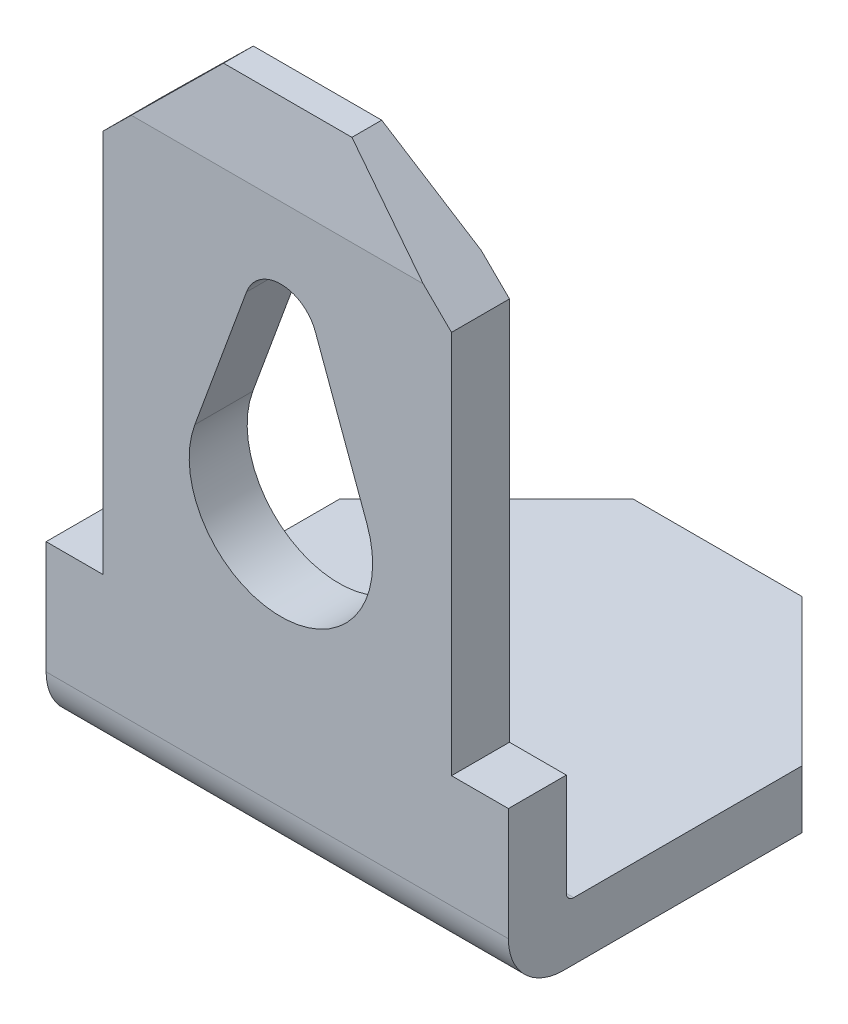
ISO-10303-21;
HEADER;
FILE_DESCRIPTION(('STEP AP214'),'2;1');
FILE_NAME('part.step','',(''),(''),'','','');
FILE_SCHEMA(('AUTOMOTIVE_DESIGN { 1 0 10303 214 1 1 1 1 }'));
ENDSEC;
DATA;
#1=APPLICATION_CONTEXT('core data for automotive mechanical design processes');
#2=APPLICATION_PROTOCOL_DEFINITION('international standard','automotive_design',2000,#1);
#3=PRODUCT_CONTEXT('',#1,'mechanical');
#4=PRODUCT('Part','Part','',(#3));
#5=PRODUCT_RELATED_PRODUCT_CATEGORY('part','',(#4));
#6=PRODUCT_DEFINITION_FORMATION('','',#4);
#7=PRODUCT_DEFINITION_CONTEXT('part definition',#1,'design');
#8=PRODUCT_DEFINITION('design','',#6,#7);
#9=PRODUCT_DEFINITION_SHAPE('','',#8);
#10=(LENGTH_UNIT() NAMED_UNIT(*) SI_UNIT(.MILLI.,.METRE.));
#11=(NAMED_UNIT(*) PLANE_ANGLE_UNIT() SI_UNIT($,.RADIAN.));
#12=(NAMED_UNIT(*) SI_UNIT($,.STERADIAN.) SOLID_ANGLE_UNIT());
#13=UNCERTAINTY_MEASURE_WITH_UNIT(LENGTH_MEASURE(1.E-05),#10,'distance_accuracy_value','');
#14=(GEOMETRIC_REPRESENTATION_CONTEXT(3) GLOBAL_UNCERTAINTY_ASSIGNED_CONTEXT((#13)) GLOBAL_UNIT_ASSIGNED_CONTEXT((#10,
#11,#12)) REPRESENTATION_CONTEXT('',''));
#15=CARTESIAN_POINT('',(0.,0.,0.));
#16=DIRECTION('',(0.,0.,1.));
#17=DIRECTION('',(1.,0.,0.));
#18=AXIS2_PLACEMENT_3D('',#15,#16,#17);
#19=CARTESIAN_POINT('',(6.3,7.11,0.));
#20=DIRECTION('',(0.,-0.214348018272917,0.976757353216485));
#21=DIRECTION('',(0.,-0.976757353216485,-0.214348018272917));
#22=AXIS2_PLACEMENT_3D('',#19,#20,#21);
#23=PLANE('',#22);
#24=DIRECTION('',(-1.,0.,0.));
#25=VECTOR('',#24,1.);
#26=CARTESIAN_POINT('',(6.3,8.21,0.24139344262295));
#27=LINE('',#26,#25);
#28=CARTESIAN_POINT('',(4.025,8.21,0.241393442622949));
#29=VERTEX_POINT('',#28);
#30=CARTESIAN_POINT('',(2.275,8.21,0.241393442622949));
#31=VERTEX_POINT('',#30);
#32=EDGE_CURVE('E205',#29,#31,#27,.T.);
#33=ORIENTED_EDGE('',*,*,#32,.F.);
#34=DIRECTION('',(0.703347952461325,-0.69432379783991,-0.152368374414198));
#35=VECTOR('',#34,1.);
#36=CARTESIAN_POINT('',(5.71349472092454,6.54316914741508,-0.124390228082159));
#37=LINE('',#36,#35);
#38=CARTESIAN_POINT('',(5.13929674470966,7.11,0.));
#39=VERTEX_POINT('',#38);
#40=EDGE_CURVE('E187',#29,#39,#37,.T.);
#41=ORIENTED_EDGE('',*,*,#40,.T.);
#42=DIRECTION('',(-1.,0.,0.));
#43=VECTOR('',#42,1.);
#44=CARTESIAN_POINT('',(6.3,7.11,0.));
#45=LINE('',#44,#43);
#46=CARTESIAN_POINT('',(1.16070325529034,7.11,0.));
#47=VERTEX_POINT('',#46);
#48=EDGE_CURVE('E245',#39,#47,#45,.T.);
#49=ORIENTED_EDGE('',*,*,#48,.T.);
#50=DIRECTION('',(0.703347952461325,0.69432379783991,0.152368374414198));
#51=VECTOR('',#50,1.);
#52=CARTESIAN_POINT('',(3.70310483513415,9.61978184321707,0.550768072151585));
#53=LINE('',#52,#51);
#54=EDGE_CURVE('E253',#47,#31,#53,.T.);
#55=ORIENTED_EDGE('',*,*,#54,.T.);
#56=EDGE_LOOP('',(#33,#41,#49,#55));
#57=FACE_BOUND('',#56,.T.);
#58=ADVANCED_FACE('F33',(#57),#23,.F.);
#59=CARTESIAN_POINT('',(6.3,8.21,0.24139344262295));
#60=DIRECTION('',(0.,-1.,0.));
#61=DIRECTION('',(0.,0.,-1.));
#62=AXIS2_PLACEMENT_3D('',#59,#60,#61);
#63=PLANE('',#62);
#64=DIRECTION('',(-1.,0.,0.));
#65=VECTOR('',#64,1.);
#66=CARTESIAN_POINT('',(6.3,8.21,0.64713114754098));
#67=LINE('',#66,#65);
#68=CARTESIAN_POINT('',(4.025,8.21,0.647131147540979));
#69=VERTEX_POINT('',#68);
#70=CARTESIAN_POINT('',(2.275,8.21,0.647131147540979));
#71=VERTEX_POINT('',#70);
#72=EDGE_CURVE('E202',#69,#71,#67,.T.);
#73=ORIENTED_EDGE('',*,*,#72,.F.);
#74=DIRECTION('',(0.,0.,1.));
#75=VECTOR('',#74,1.);
#76=CARTESIAN_POINT('',(4.025,8.21,-5.21));
#77=LINE('',#76,#75);
#78=EDGE_CURVE('E182',#29,#69,#77,.T.);
#79=ORIENTED_EDGE('',*,*,#78,.F.);
#80=ORIENTED_EDGE('',*,*,#32,.T.);
#81=DIRECTION('',(0.,0.,1.));
#82=VECTOR('',#81,1.);
#83=CARTESIAN_POINT('',(2.275,8.21,-5.21));
#84=LINE('',#83,#82);
#85=EDGE_CURVE('E197',#31,#71,#84,.T.);
#86=ORIENTED_EDGE('',*,*,#85,.T.);
#87=EDGE_LOOP('',(#73,#79,#80,#86));
#88=FACE_BOUND('',#87,.T.);
#89=ADVANCED_FACE('F414',(#88),#63,.F.);
#90=CARTESIAN_POINT('',(6.3,8.21,0.64713114754098));
#91=DIRECTION('',(0.,-0.128798962302804,-0.991670725245896));
#92=DIRECTION('',(0.,0.991670725245896,-0.128798962302804));
#93=AXIS2_PLACEMENT_3D('',#90,#91,#92);
#94=PLANE('',#93);
#95=DIRECTION('',(-1.,0.,0.));
#96=VECTOR('',#95,1.);
#97=CARTESIAN_POINT('',(6.3,7.11,0.79));
#98=LINE('',#97,#96);
#99=CARTESIAN_POINT('',(5.13929674470966,7.11,0.79));
#100=VERTEX_POINT('',#99);
#101=CARTESIAN_POINT('',(1.16070325529034,7.11,0.79));
#102=VERTEX_POINT('',#101);
#103=EDGE_CURVE('E194',#100,#102,#98,.T.);
#104=ORIENTED_EDGE('',*,*,#103,.F.);
#105=DIRECTION('',(-0.708713311399784,0.69962031769454,-0.0908672290418487));
#106=VECTOR('',#105,1.);
#107=CARTESIAN_POINT('',(5.16767461889319,7.0819862220274,0.793638451192715));
#108=LINE('',#107,#106);
#109=EDGE_CURVE('E179',#100,#69,#108,.T.);
#110=ORIENTED_EDGE('',*,*,#109,.T.);
#111=ORIENTED_EDGE('',*,*,#72,.T.);
#112=DIRECTION('',(-0.708713311399784,-0.69962031769454,0.0908672290418487));
#113=VECTOR('',#112,1.);
#114=CARTESIAN_POINT('',(4.29665509496487,10.2057166841054,0.387925918003296));
#115=LINE('',#114,#113);
#116=EDGE_CURVE('E201',#71,#102,#115,.T.);
#117=ORIENTED_EDGE('',*,*,#116,.T.);
#118=EDGE_LOOP('',(#104,#110,#111,#117));
#119=FACE_BOUND('',#118,.T.);
#120=ADVANCED_FACE('F200',(#119),#94,.F.);
#121=CARTESIAN_POINT('',(6.3,7.11,0.79));
#122=DIRECTION('',(0.,0.,-1.));
#123=DIRECTION('',(0.,1.,0.));
#124=AXIS2_PLACEMENT_3D('',#121,#122,#123);
#125=PLANE('',#124);
#126=DIRECTION('',(-0.344583937553277,-0.938755511291561,0.));
#127=VECTOR('',#126,1.);
#128=CARTESIAN_POINT('',(2.73062224435422,5.80882986931079,0.789999999999999));
#129=LINE('',#128,#127);
#130=CARTESIAN_POINT('',(2.73062224435422,5.80882986931079,0.79));
#131=VERTEX_POINT('',#130);
#132=CARTESIAN_POINT('',(2.02655561088555,3.89072992194159,0.789999999999999));
#133=VERTEX_POINT('',#132);
#134=EDGE_CURVE('E294',#131,#133,#129,.T.);
#135=ORIENTED_EDGE('',*,*,#134,.F.);
#136=CARTESIAN_POINT('',(3.2,5.63653790053415,0.789999999999999));
#137=DIRECTION('',(0.,0.,1.));
#138=DIRECTION('',(1.,0.,0.));
#139=AXIS2_PLACEMENT_3D('',#136,#137,#138);
#140=CIRCLE('',#139,0.5);
#141=CARTESIAN_POINT('',(3.66963395220552,5.8081302981974,0.789999999999999));
#142=VERTEX_POINT('',#141);
#143=EDGE_CURVE('E270',#142,#131,#140,.T.);
#144=ORIENTED_EDGE('',*,*,#143,.F.);
#145=DIRECTION('',(-0.344584192655147,0.938755417652649,0.));
#146=VECTOR('',#145,1.);
#147=CARTESIAN_POINT('',(3.66963395220552,5.8081302981974,0.789999999999999));
#148=LINE('',#147,#146);
#149=CARTESIAN_POINT('',(4.37344427206581,3.89073024081893,0.789999999999999));
#150=VERTEX_POINT('',#149);
#151=EDGE_CURVE('E300',#150,#142,#148,.T.);
#152=ORIENTED_EDGE('',*,*,#151,.F.);
#153=CARTESIAN_POINT('',(3.2,3.46,0.789999999999999));
#154=DIRECTION('',(0.,0.,1.));
#155=DIRECTION('',(1.,0.,0.));
#156=AXIS2_PLACEMENT_3D('',#153,#154,#155);
#157=CIRCLE('',#156,1.25);
#158=EDGE_CURVE('E297',#133,#150,#157,.T.);
#159=ORIENTED_EDGE('',*,*,#158,.F.);
#160=EDGE_LOOP('',(#135,#144,#152,#159));
#161=FACE_BOUND('',#160,.T.);
#162=DIRECTION('',(0.,-1.,0.));
#163=VECTOR('',#162,1.);
#164=CARTESIAN_POINT('',(5.525,1.49672365683442,0.789999999999999));
#165=LINE('',#164,#163);
#166=CARTESIAN_POINT('',(5.525,6.729245427366,0.79));
#167=VERTEX_POINT('',#166);
#168=CARTESIAN_POINT('',(5.525,1.49672365683442,0.789999999999999));
#169=VERTEX_POINT('',#168);
#170=EDGE_CURVE('E196',#167,#169,#165,.T.);
#171=ORIENTED_EDGE('',*,*,#170,.F.);
#172=DIRECTION('',(0.711657426770076,-0.702526659225822,0.));
#173=VECTOR('',#172,1.);
#174=CARTESIAN_POINT('',(5.54449556096771,6.71,0.79));
#175=LINE('',#174,#173);
#176=EDGE_CURVE('E55',#100,#167,#175,.T.);
#177=ORIENTED_EDGE('',*,*,#176,.F.);
#178=ORIENTED_EDGE('',*,*,#103,.T.);
#179=DIRECTION('',(0.711657426770076,0.702526659225822,0.));
#180=VECTOR('',#179,1.);
#181=CARTESIAN_POINT('',(0.755504439032288,6.71,0.79));
#182=LINE('',#181,#180);
#183=CARTESIAN_POINT('',(0.775,6.729245427366,0.79));
#184=VERTEX_POINT('',#183);
#185=EDGE_CURVE('E562',#184,#102,#182,.T.);
#186=ORIENTED_EDGE('',*,*,#185,.F.);
#187=DIRECTION('',(0.,1.,0.));
#188=VECTOR('',#187,1.);
#189=CARTESIAN_POINT('',(0.775,1.49672365683442,0.789999999999999));
#190=LINE('',#189,#188);
#191=CARTESIAN_POINT('',(0.775,1.49672365683442,0.789999999999999));
#192=VERTEX_POINT('',#191);
#193=EDGE_CURVE('E271',#192,#184,#190,.T.);
#194=ORIENTED_EDGE('',*,*,#193,.F.);
#195=DIRECTION('',(1.,0.,0.));
#196=VECTOR('',#195,1.);
#197=CARTESIAN_POINT('',(0.,1.49672365683442,0.789999999999999));
#198=LINE('',#197,#196);
#199=CARTESIAN_POINT('',(0.,1.49672365683442,0.789999999999999));
#200=VERTEX_POINT('',#199);
#201=EDGE_CURVE('E264',#200,#192,#198,.T.);
#202=ORIENTED_EDGE('',*,*,#201,.F.);
#203=DIRECTION('',(0.,-1.,0.));
#204=VECTOR('',#203,1.);
#205=CARTESIAN_POINT('',(0.,7.11,0.79));
#206=LINE('',#205,#204);
#207=CARTESIAN_POINT('',(0.,-0.0400000000000005,0.789999999999999));
#208=VERTEX_POINT('',#207);
#209=EDGE_CURVE('E312',#200,#208,#206,.T.);
#210=ORIENTED_EDGE('',*,*,#209,.T.);
#211=DIRECTION('',(-1.,0.,0.));
#212=VECTOR('',#211,1.);
#213=CARTESIAN_POINT('',(6.3,-0.0400000000000005,0.789999999999999));
#214=LINE('',#213,#212);
#215=CARTESIAN_POINT('',(6.3,-0.0400000000000005,0.789999999999999));
#216=VERTEX_POINT('',#215);
#217=EDGE_CURVE('E203',#216,#208,#214,.T.);
#218=ORIENTED_EDGE('',*,*,#217,.F.);
#219=DIRECTION('',(0.,-1.,0.));
#220=VECTOR('',#219,1.);
#221=CARTESIAN_POINT('',(6.3,7.11,0.79));
#222=LINE('',#221,#220);
#223=CARTESIAN_POINT('',(6.3,1.49672365683442,0.789999999999999));
#224=VERTEX_POINT('',#223);
#225=EDGE_CURVE('E313',#224,#216,#222,.T.);
#226=ORIENTED_EDGE('',*,*,#225,.F.);
#227=DIRECTION('',(1.,0.,0.));
#228=VECTOR('',#227,1.);
#229=CARTESIAN_POINT('',(6.3,1.49672365683442,0.789999999999999));
#230=LINE('',#229,#228);
#231=EDGE_CURVE('E259',#169,#224,#230,.T.);
#232=ORIENTED_EDGE('',*,*,#231,.F.);
#233=EDGE_LOOP('',(#171,#177,#178,#186,#194,#202,#210,#218,#226,#232));
#234=FACE_BOUND('',#233,.T.);
#235=ADVANCED_FACE('F192',(#161,#234),#125,.F.);
#236=CARTESIAN_POINT('',(6.3,-0.0400000000000006,0.0399999999999991));
#237=DIRECTION('',(-1.,0.,0.));
#238=DIRECTION('',(0.,0.,1.));
#239=AXIS2_PLACEMENT_3D('',#236,#237,#238);
#240=CYLINDRICAL_SURFACE('',#239,0.75);
#241=CARTESIAN_POINT('',(0.,-0.0400000000000006,0.0399999999999991));
#242=DIRECTION('',(1.,0.,0.));
#243=DIRECTION('',(0.,0.,-1.));
#244=AXIS2_PLACEMENT_3D('',#241,#242,#243);
#245=CIRCLE('',#244,0.75);
#246=CARTESIAN_POINT('',(0.,-0.790000000000001,0.0399999999999991));
#247=VERTEX_POINT('',#246);
#248=EDGE_CURVE('E329',#208,#247,#245,.T.);
#249=ORIENTED_EDGE('',*,*,#248,.T.);
#250=DIRECTION('',(-1.,0.,0.));
#251=VECTOR('',#250,1.);
#252=CARTESIAN_POINT('',(6.3,-0.790000000000001,0.0399999999999991));
#253=LINE('',#252,#251);
#254=CARTESIAN_POINT('',(6.3,-0.790000000000001,0.0399999999999991));
#255=VERTEX_POINT('',#254);
#256=EDGE_CURVE('E208',#255,#247,#253,.T.);
#257=ORIENTED_EDGE('',*,*,#256,.F.);
#258=CARTESIAN_POINT('',(6.3,-0.0400000000000006,0.0399999999999991));
#259=DIRECTION('',(1.,0.,0.));
#260=DIRECTION('',(0.,0.,-1.));
#261=AXIS2_PLACEMENT_3D('',#258,#259,#260);
#262=CIRCLE('',#261,0.75);
#263=EDGE_CURVE('E315',#216,#255,#262,.T.);
#264=ORIENTED_EDGE('',*,*,#263,.F.);
#265=ORIENTED_EDGE('',*,*,#217,.T.);
#266=EDGE_LOOP('',(#249,#257,#264,#265));
#267=FACE_BOUND('',#266,.T.);
#268=ADVANCED_FACE('F385',(#267),#240,.T.);
#269=CARTESIAN_POINT('',(6.3,-0.790000000000001,0.0399999999999991));
#270=DIRECTION('',(0.,1.,0.));
#271=DIRECTION('',(0.,0.,1.));
#272=AXIS2_PLACEMENT_3D('',#269,#270,#271);
#273=PLANE('',#272);
#274=DIRECTION('',(-1.,0.,0.));
#275=VECTOR('',#274,1.);
#276=CARTESIAN_POINT('',(6.3,-0.790000000000001,-5.21));
#277=LINE('',#276,#275);
#278=CARTESIAN_POINT('',(4.29999999999999,-0.790000000000001,-5.21));
#279=VERTEX_POINT('',#278);
#280=CARTESIAN_POINT('',(2.,-0.790000000000001,-5.21));
#281=VERTEX_POINT('',#280);
#282=EDGE_CURVE('E350',#279,#281,#277,.T.);
#283=ORIENTED_EDGE('',*,*,#282,.F.);
#284=DIRECTION('',(0.707106781186549,0.,0.707106781186546));
#285=VECTOR('',#284,1.);
#286=CARTESIAN_POINT('',(6.3,-0.790000000000001,-3.21));
#287=LINE('',#286,#285);
#288=CARTESIAN_POINT('',(6.3,-0.790000000000001,-3.21));
#289=VERTEX_POINT('',#288);
#290=EDGE_CURVE('E228',#279,#289,#287,.T.);
#291=ORIENTED_EDGE('',*,*,#290,.T.);
#292=DIRECTION('',(0.,0.,-1.));
#293=VECTOR('',#292,1.);
#294=CARTESIAN_POINT('',(6.3,-0.790000000000001,0.0399999999999991));
#295=LINE('',#294,#293);
#296=EDGE_CURVE('E318',#255,#289,#295,.T.);
#297=ORIENTED_EDGE('',*,*,#296,.F.);
#298=ORIENTED_EDGE('',*,*,#256,.T.);
#299=DIRECTION('',(0.,0.,-1.));
#300=VECTOR('',#299,1.);
#301=CARTESIAN_POINT('',(0.,-0.790000000000001,0.0399999999999991));
#302=LINE('',#301,#300);
#303=CARTESIAN_POINT('',(0.,-0.790000000000001,-3.21));
#304=VERTEX_POINT('',#303);
#305=EDGE_CURVE('E331',#247,#304,#302,.T.);
#306=ORIENTED_EDGE('',*,*,#305,.T.);
#307=DIRECTION('',(-0.707106781186546,0.,0.707106781186549));
#308=VECTOR('',#307,1.);
#309=CARTESIAN_POINT('',(2.,-0.790000000000001,-5.21));
#310=LINE('',#309,#308);
#311=EDGE_CURVE('E226',#304,#281,#310,.F.);
#312=ORIENTED_EDGE('',*,*,#311,.T.);
#313=EDGE_LOOP('',(#283,#291,#297,#298,#306,#312));
#314=FACE_BOUND('',#313,.T.);
#315=ADVANCED_FACE('F358',(#314),#273,.F.);
#316=CARTESIAN_POINT('',(6.3,-0.790000000000001,-5.21));
#317=DIRECTION('',(0.,0.,1.));
#318=DIRECTION('',(1.,0.,0.));
#319=AXIS2_PLACEMENT_3D('',#316,#317,#318);
#320=PLANE('',#319);
#321=DIRECTION('',(-1.,0.,0.));
#322=VECTOR('',#321,1.);
#323=CARTESIAN_POINT('',(6.3,0.,-5.21));
#324=LINE('',#323,#322);
#325=CARTESIAN_POINT('',(4.29999999999999,0.,-5.21));
#326=VERTEX_POINT('',#325);
#327=CARTESIAN_POINT('',(2.,0.,-5.21));
#328=VERTEX_POINT('',#327);
#329=EDGE_CURVE('E347',#326,#328,#324,.T.);
#330=ORIENTED_EDGE('',*,*,#329,.F.);
#331=DIRECTION('',(0.,-1.,0.));
#332=VECTOR('',#331,1.);
#333=CARTESIAN_POINT('',(4.29999999999999,-0.790000000000001,-5.21));
#334=LINE('',#333,#332);
#335=EDGE_CURVE('E224',#326,#279,#334,.T.);
#336=ORIENTED_EDGE('',*,*,#335,.T.);
#337=ORIENTED_EDGE('',*,*,#282,.T.);
#338=DIRECTION('',(0.,1.,0.));
#339=VECTOR('',#338,1.);
#340=CARTESIAN_POINT('',(2.,-0.790000000000001,-5.21));
#341=LINE('',#340,#339);
#342=EDGE_CURVE('E221',#281,#328,#341,.T.);
#343=ORIENTED_EDGE('',*,*,#342,.T.);
#344=EDGE_LOOP('',(#330,#336,#337,#343));
#345=FACE_BOUND('',#344,.T.);
#346=ADVANCED_FACE('F374',(#345),#320,.F.);
#347=CARTESIAN_POINT('',(6.3,0.,-5.21));
#348=DIRECTION('',(0.,-1.,0.));
#349=DIRECTION('',(0.,0.,-1.));
#350=AXIS2_PLACEMENT_3D('',#347,#348,#349);
#351=PLANE('',#350);
#352=DIRECTION('',(0.,0.,1.));
#353=VECTOR('',#352,1.);
#354=CARTESIAN_POINT('',(6.3,0.,-5.21));
#355=LINE('',#354,#353);
#356=CARTESIAN_POINT('',(6.3,0.,-3.21));
#357=VERTEX_POINT('',#356);
#358=CARTESIAN_POINT('',(6.3,0.,-0.100000000000001));
#359=VERTEX_POINT('',#358);
#360=EDGE_CURVE('E321',#357,#359,#355,.T.);
#361=ORIENTED_EDGE('',*,*,#360,.F.);
#362=DIRECTION('',(-0.707106781186549,0.,-0.707106781186546));
#363=VECTOR('',#362,1.);
#364=CARTESIAN_POINT('',(6.3,0.,-3.21));
#365=LINE('',#364,#363);
#366=EDGE_CURVE('E219',#357,#326,#365,.T.);
#367=ORIENTED_EDGE('',*,*,#366,.T.);
#368=ORIENTED_EDGE('',*,*,#329,.T.);
#369=DIRECTION('',(0.707106781186546,0.,-0.707106781186549));
#370=VECTOR('',#369,1.);
#371=CARTESIAN_POINT('',(2.,0.,-5.21));
#372=LINE('',#371,#370);
#373=CARTESIAN_POINT('',(0.,0.,-3.21));
#374=VERTEX_POINT('',#373);
#375=EDGE_CURVE('E217',#328,#374,#372,.F.);
#376=ORIENTED_EDGE('',*,*,#375,.T.);
#377=DIRECTION('',(0.,0.,1.));
#378=VECTOR('',#377,1.);
#379=CARTESIAN_POINT('',(0.,0.,-5.21));
#380=LINE('',#379,#378);
#381=CARTESIAN_POINT('',(0.,0.,-0.100000000000001));
#382=VERTEX_POINT('',#381);
#383=EDGE_CURVE('E334',#374,#382,#380,.T.);
#384=ORIENTED_EDGE('',*,*,#383,.T.);
#385=DIRECTION('',(-1.,0.,0.));
#386=VECTOR('',#385,1.);
#387=CARTESIAN_POINT('',(6.3,0.,-0.100000000000001));
#388=LINE('',#387,#386);
#389=EDGE_CURVE('E344',#359,#382,#388,.T.);
#390=ORIENTED_EDGE('',*,*,#389,.F.);
#391=EDGE_LOOP('',(#361,#367,#368,#376,#384,#390));
#392=FACE_BOUND('',#391,.T.);
#393=ADVANCED_FACE('F399',(#392),#351,.F.);
#394=CARTESIAN_POINT('',(6.3,0.1,-0.1));
#395=DIRECTION('',(-1.,0.,0.));
#396=DIRECTION('',(0.,0.,1.));
#397=AXIS2_PLACEMENT_3D('',#394,#395,#396);
#398=CYLINDRICAL_SURFACE('',#397,0.1);
#399=CARTESIAN_POINT('',(0.,0.1,-0.1));
#400=DIRECTION('',(-1.,0.,0.));
#401=DIRECTION('',(0.,0.,-1.));
#402=AXIS2_PLACEMENT_3D('',#399,#400,#401);
#403=CIRCLE('',#402,0.1);
#404=CARTESIAN_POINT('',(0.,0.100000000000001,0.));
#405=VERTEX_POINT('',#404);
#406=EDGE_CURVE('E336',#382,#405,#403,.T.);
#407=ORIENTED_EDGE('',*,*,#406,.T.);
#408=DIRECTION('',(-1.,0.,0.));
#409=VECTOR('',#408,1.);
#410=CARTESIAN_POINT('',(6.3,0.100000000000001,0.));
#411=LINE('',#410,#409);
#412=CARTESIAN_POINT('',(6.3,0.100000000000001,0.));
#413=VERTEX_POINT('',#412);
#414=EDGE_CURVE('E341',#413,#405,#411,.T.);
#415=ORIENTED_EDGE('',*,*,#414,.F.);
#416=CARTESIAN_POINT('',(6.3,0.1,-0.1));
#417=DIRECTION('',(-1.,0.,0.));
#418=DIRECTION('',(0.,0.,-1.));
#419=AXIS2_PLACEMENT_3D('',#416,#417,#418);
#420=CIRCLE('',#419,0.1);
#421=EDGE_CURVE('E323',#359,#413,#420,.T.);
#422=ORIENTED_EDGE('',*,*,#421,.F.);
#423=ORIENTED_EDGE('',*,*,#389,.T.);
#424=EDGE_LOOP('',(#407,#415,#422,#423));
#425=FACE_BOUND('',#424,.T.);
#426=ADVANCED_FACE('F396',(#425),#398,.F.);
#427=CARTESIAN_POINT('',(6.3,0.100000000000001,0.));
#428=DIRECTION('',(0.,0.,1.));
#429=DIRECTION('',(0.,-1.,0.));
#430=AXIS2_PLACEMENT_3D('',#427,#428,#429);
#431=PLANE('',#430);
#432=DIRECTION('',(0.344584192655147,-0.938755417652649,0.));
#433=VECTOR('',#432,1.);
#434=CARTESIAN_POINT('',(3.66963395220552,5.8081302981974,0.));
#435=LINE('',#434,#433);
#436=CARTESIAN_POINT('',(3.66963395220552,5.8081302981974,0.));
#437=VERTEX_POINT('',#436);
#438=CARTESIAN_POINT('',(4.37344427206581,3.89073024081893,0.));
#439=VERTEX_POINT('',#438);
#440=EDGE_CURVE('E287',#437,#439,#435,.T.);
#441=ORIENTED_EDGE('',*,*,#440,.F.);
#442=CARTESIAN_POINT('',(3.2,5.63653790053415,0.));
#443=DIRECTION('',(0.,0.,1.));
#444=DIRECTION('',(0.,-1.,0.));
#445=AXIS2_PLACEMENT_3D('',#442,#443,#444);
#446=CIRCLE('',#445,0.5);
#447=CARTESIAN_POINT('',(2.73062224435422,5.80882986931079,0.));
#448=VERTEX_POINT('',#447);
#449=EDGE_CURVE('E290',#448,#437,#446,.F.);
#450=ORIENTED_EDGE('',*,*,#449,.F.);
#451=DIRECTION('',(0.344583937553277,0.938755511291561,0.));
#452=VECTOR('',#451,1.);
#453=CARTESIAN_POINT('',(2.73062224435422,5.80882986931079,0.));
#454=LINE('',#453,#452);
#455=CARTESIAN_POINT('',(2.02655561088555,3.89072992194159,0.));
#456=VERTEX_POINT('',#455);
#457=EDGE_CURVE('E292',#456,#448,#454,.T.);
#458=ORIENTED_EDGE('',*,*,#457,.F.);
#459=CARTESIAN_POINT('',(3.2,3.46,0.));
#460=DIRECTION('',(0.,0.,1.));
#461=DIRECTION('',(0.,-1.,0.));
#462=AXIS2_PLACEMENT_3D('',#459,#460,#461);
#463=CIRCLE('',#462,1.25);
#464=EDGE_CURVE('E284',#439,#456,#463,.F.);
#465=ORIENTED_EDGE('',*,*,#464,.F.);
#466=EDGE_LOOP('',(#441,#450,#458,#465));
#467=FACE_BOUND('',#466,.T.);
#468=ORIENTED_EDGE('',*,*,#48,.F.);
#469=DIRECTION('',(0.711657426770076,-0.702526659225822,0.));
#470=VECTOR('',#469,1.);
#471=CARTESIAN_POINT('',(9.23184999768602,3.06995537127141,0.));
#472=LINE('',#471,#470);
#473=CARTESIAN_POINT('',(5.525,6.729245427366,0.));
#474=VERTEX_POINT('',#473);
#475=EDGE_CURVE('E238',#39,#474,#472,.T.);
#476=ORIENTED_EDGE('',*,*,#475,.T.);
#477=DIRECTION('',(0.,1.,0.));
#478=VECTOR('',#477,1.);
#479=CARTESIAN_POINT('',(5.525,1.49672365683442,0.));
#480=LINE('',#479,#478);
#481=CARTESIAN_POINT('',(5.525,1.49672365683442,0.));
#482=VERTEX_POINT('',#481);
#483=EDGE_CURVE('E236',#482,#474,#480,.T.);
#484=ORIENTED_EDGE('',*,*,#483,.F.);
#485=DIRECTION('',(-1.,0.,0.));
#486=VECTOR('',#485,1.);
#487=CARTESIAN_POINT('',(6.3,1.49672365683442,0.));
#488=LINE('',#487,#486);
#489=CARTESIAN_POINT('',(6.3,1.49672365683442,0.));
#490=VERTEX_POINT('',#489);
#491=EDGE_CURVE('E261',#490,#482,#488,.T.);
#492=ORIENTED_EDGE('',*,*,#491,.F.);
#493=DIRECTION('',(0.,1.,0.));
#494=VECTOR('',#493,1.);
#495=CARTESIAN_POINT('',(6.3,0.100000000000001,0.));
#496=LINE('',#495,#494);
#497=EDGE_CURVE('E325',#413,#490,#496,.T.);
#498=ORIENTED_EDGE('',*,*,#497,.F.);
#499=ORIENTED_EDGE('',*,*,#414,.T.);
#500=DIRECTION('',(0.,1.,0.));
#501=VECTOR('',#500,1.);
#502=CARTESIAN_POINT('',(0.,0.100000000000001,0.));
#503=LINE('',#502,#501);
#504=CARTESIAN_POINT('',(0.,1.49672365683442,0.));
#505=VERTEX_POINT('',#504);
#506=EDGE_CURVE('E316',#405,#505,#503,.T.);
#507=ORIENTED_EDGE('',*,*,#506,.T.);
#508=DIRECTION('',(-1.,0.,0.));
#509=VECTOR('',#508,1.);
#510=CARTESIAN_POINT('',(0.,1.49672365683442,0.));
#511=LINE('',#510,#509);
#512=CARTESIAN_POINT('',(0.775,1.49672365683442,0.));
#513=VERTEX_POINT('',#512);
#514=EDGE_CURVE('E277',#513,#505,#511,.T.);
#515=ORIENTED_EDGE('',*,*,#514,.F.);
#516=DIRECTION('',(0.,-1.,0.));
#517=VECTOR('',#516,1.);
#518=CARTESIAN_POINT('',(0.775,1.49672365683442,0.));
#519=LINE('',#518,#517);
#520=CARTESIAN_POINT('',(0.775,6.729245427366,0.));
#521=VERTEX_POINT('',#520);
#522=EDGE_CURVE('E257',#521,#513,#519,.T.);
#523=ORIENTED_EDGE('',*,*,#522,.F.);
#524=DIRECTION('',(0.711657426770076,0.702526659225822,0.));
#525=VECTOR('',#524,1.);
#526=CARTESIAN_POINT('',(0.258824648699115,6.21969275288617,0.));
#527=LINE('',#526,#525);
#528=EDGE_CURVE('E48',#521,#47,#527,.T.);
#529=ORIENTED_EDGE('',*,*,#528,.T.);
#530=EDGE_LOOP('',(#468,#476,#484,#492,#498,#499,#507,#515,#523,#529));
#531=FACE_BOUND('',#530,.T.);
#532=ADVANCED_FACE('F242',(#467,#531),#431,.F.);
#533=CARTESIAN_POINT('',(6.3,-0.0400000000000006,0.0399999999999991));
#534=DIRECTION('',(1.,0.,0.));
#535=DIRECTION('',(0.,0.,-1.));
#536=AXIS2_PLACEMENT_3D('',#533,#534,#535);
#537=PLANE('',#536);
#538=DIRECTION('',(0.,0.,-1.));
#539=VECTOR('',#538,1.);
#540=CARTESIAN_POINT('',(6.3,1.49672365683442,7.54786240313508));
#541=LINE('',#540,#539);
#542=EDGE_CURVE('E266',#224,#490,#541,.T.);
#543=ORIENTED_EDGE('',*,*,#542,.F.);
#544=ORIENTED_EDGE('',*,*,#225,.T.);
#545=ORIENTED_EDGE('',*,*,#263,.T.);
#546=ORIENTED_EDGE('',*,*,#296,.T.);
#547=DIRECTION('',(0.,1.,0.));
#548=VECTOR('',#547,1.);
#549=CARTESIAN_POINT('',(6.3,0.,-3.21));
#550=LINE('',#549,#548);
#551=EDGE_CURVE('E214',#289,#357,#550,.T.);
#552=ORIENTED_EDGE('',*,*,#551,.T.);
#553=ORIENTED_EDGE('',*,*,#360,.T.);
#554=ORIENTED_EDGE('',*,*,#421,.T.);
#555=ORIENTED_EDGE('',*,*,#497,.T.);
#556=EDGE_LOOP('',(#543,#544,#545,#546,#552,#553,#554,#555));
#557=FACE_BOUND('',#556,.T.);
#558=ADVANCED_FACE('F381',(#557),#537,.T.);
#559=CARTESIAN_POINT('',(0.,-0.0400000000000006,0.0399999999999991));
#560=DIRECTION('',(1.,0.,0.));
#561=DIRECTION('',(0.,0.,-1.));
#562=AXIS2_PLACEMENT_3D('',#559,#560,#561);
#563=PLANE('',#562);
#564=ORIENTED_EDGE('',*,*,#209,.F.);
#565=DIRECTION('',(0.,0.,-1.));
#566=VECTOR('',#565,1.);
#567=CARTESIAN_POINT('',(0.,1.49672365683442,7.54786240313508));
#568=LINE('',#567,#566);
#569=EDGE_CURVE('E274',#200,#505,#568,.T.);
#570=ORIENTED_EDGE('',*,*,#569,.T.);
#571=ORIENTED_EDGE('',*,*,#506,.F.);
#572=ORIENTED_EDGE('',*,*,#406,.F.);
#573=ORIENTED_EDGE('',*,*,#383,.F.);
#574=DIRECTION('',(0.,-1.,0.));
#575=VECTOR('',#574,1.);
#576=CARTESIAN_POINT('',(0.,-0.0400000000000006,-3.21));
#577=LINE('',#576,#575);
#578=EDGE_CURVE('E230',#374,#304,#577,.T.);
#579=ORIENTED_EDGE('',*,*,#578,.T.);
#580=ORIENTED_EDGE('',*,*,#305,.F.);
#581=ORIENTED_EDGE('',*,*,#248,.F.);
#582=EDGE_LOOP('',(#564,#570,#571,#572,#573,#579,#580,#581));
#583=FACE_BOUND('',#582,.T.);
#584=ADVANCED_FACE('F365',(#583),#563,.F.);
#585=CARTESIAN_POINT('',(6.3,-0.0400000000000006,-3.21));
#586=DIRECTION('',(0.707106781186546,0.,-0.707106781186549));
#587=DIRECTION('',(0.,-1.,0.));
#588=AXIS2_PLACEMENT_3D('',#585,#586,#587);
#589=PLANE('',#588);
#590=ORIENTED_EDGE('',*,*,#290,.F.);
#591=ORIENTED_EDGE('',*,*,#335,.F.);
#592=ORIENTED_EDGE('',*,*,#366,.F.);
#593=ORIENTED_EDGE('',*,*,#551,.F.);
#594=EDGE_LOOP('',(#590,#591,#592,#593));
#595=FACE_BOUND('',#594,.T.);
#596=ADVANCED_FACE('F377',(#595),#589,.T.);
#597=CARTESIAN_POINT('',(2.,-0.790000000000001,-5.21));
#598=DIRECTION('',(0.707106781186549,0.,0.707106781186546));
#599=DIRECTION('',(0.,1.,0.));
#600=AXIS2_PLACEMENT_3D('',#597,#598,#599);
#601=PLANE('',#600);
#602=ORIENTED_EDGE('',*,*,#311,.F.);
#603=ORIENTED_EDGE('',*,*,#578,.F.);
#604=ORIENTED_EDGE('',*,*,#375,.F.);
#605=ORIENTED_EDGE('',*,*,#342,.F.);
#606=EDGE_LOOP('',(#602,#603,#604,#605));
#607=FACE_BOUND('',#606,.T.);
#608=ADVANCED_FACE('F35',(#607),#601,.F.);
#609=CARTESIAN_POINT('',(3.2,5.63653790053415,-4.65485766531385));
#610=DIRECTION('',(0.,0.,1.));
#611=DIRECTION('',(1.,0.,0.));
#612=AXIS2_PLACEMENT_3D('',#609,#610,#611);
#613=CYLINDRICAL_SURFACE('',#612,0.5);
#614=ORIENTED_EDGE('',*,*,#449,.T.);
#615=DIRECTION('',(0.,0.,1.));
#616=VECTOR('',#615,1.);
#617=CARTESIAN_POINT('',(3.66963395220552,5.8081302981974,-4.65485766531385));
#618=LINE('',#617,#616);
#619=EDGE_CURVE('E288',#437,#142,#618,.T.);
#620=ORIENTED_EDGE('',*,*,#619,.T.);
#621=ORIENTED_EDGE('',*,*,#143,.T.);
#622=DIRECTION('',(0.,0.,1.));
#623=VECTOR('',#622,1.);
#624=CARTESIAN_POINT('',(2.73062224435422,5.80882986931079,-4.65485766531385));
#625=LINE('',#624,#623);
#626=EDGE_CURVE('E303',#448,#131,#625,.T.);
#627=ORIENTED_EDGE('',*,*,#626,.F.);
#628=EDGE_LOOP('',(#614,#620,#621,#627));
#629=FACE_BOUND('',#628,.T.);
#630=ADVANCED_FACE('F429',(#629),#613,.F.);
#631=CARTESIAN_POINT('',(3.66963395220552,5.8081302981974,-4.65485766531385));
#632=DIRECTION('',(0.93875541765265,0.344584192655147,0.));
#633=DIRECTION('',(-0.344584192655147,0.938755417652649,0.));
#634=AXIS2_PLACEMENT_3D('',#631,#632,#633);
#635=PLANE('',#634);
#636=ORIENTED_EDGE('',*,*,#440,.T.);
#637=DIRECTION('',(0.,0.,1.));
#638=VECTOR('',#637,1.);
#639=CARTESIAN_POINT('',(4.37344427206581,3.89073024081893,-4.65485766531385));
#640=LINE('',#639,#638);
#641=EDGE_CURVE('E305',#439,#150,#640,.T.);
#642=ORIENTED_EDGE('',*,*,#641,.T.);
#643=ORIENTED_EDGE('',*,*,#151,.T.);
#644=ORIENTED_EDGE('',*,*,#619,.F.);
#645=EDGE_LOOP('',(#636,#642,#643,#644));
#646=FACE_BOUND('',#645,.T.);
#647=ADVANCED_FACE('F571',(#646),#635,.F.);
#648=CARTESIAN_POINT('',(3.2,3.46,-4.65485766531385));
#649=DIRECTION('',(0.,0.,1.));
#650=DIRECTION('',(1.,0.,0.));
#651=AXIS2_PLACEMENT_3D('',#648,#649,#650);
#652=CYLINDRICAL_SURFACE('',#651,1.25);
#653=ORIENTED_EDGE('',*,*,#464,.T.);
#654=DIRECTION('',(0.,0.,1.));
#655=VECTOR('',#654,1.);
#656=CARTESIAN_POINT('',(2.02655561088555,3.89072992194159,-4.65485766531385));
#657=LINE('',#656,#655);
#658=EDGE_CURVE('E307',#456,#133,#657,.T.);
#659=ORIENTED_EDGE('',*,*,#658,.T.);
#660=ORIENTED_EDGE('',*,*,#158,.T.);
#661=ORIENTED_EDGE('',*,*,#641,.F.);
#662=EDGE_LOOP('',(#653,#659,#660,#661));
#663=FACE_BOUND('',#662,.T.);
#664=ADVANCED_FACE('F567',(#663),#652,.F.);
#665=CARTESIAN_POINT('',(2.73062224435422,5.80882986931079,-4.65485766531385));
#666=DIRECTION('',(-0.938755511291561,0.344583937553277,0.));
#667=DIRECTION('',(-0.344583937553277,-0.938755511291561,0.));
#668=AXIS2_PLACEMENT_3D('',#665,#666,#667);
#669=PLANE('',#668);
#670=ORIENTED_EDGE('',*,*,#457,.T.);
#671=ORIENTED_EDGE('',*,*,#626,.T.);
#672=ORIENTED_EDGE('',*,*,#134,.T.);
#673=ORIENTED_EDGE('',*,*,#658,.F.);
#674=EDGE_LOOP('',(#670,#671,#672,#673));
#675=FACE_BOUND('',#674,.T.);
#676=ADVANCED_FACE('F496',(#675),#669,.F.);
#677=CARTESIAN_POINT('',(0.775,1.49672365683442,7.54786240313508));
#678=DIRECTION('',(1.,0.,0.));
#679=DIRECTION('',(0.,0.,-1.));
#680=AXIS2_PLACEMENT_3D('',#677,#678,#679);
#681=PLANE('',#680);
#682=ORIENTED_EDGE('',*,*,#193,.T.);
#683=DIRECTION('',(0.,0.,-1.));
#684=VECTOR('',#683,1.);
#685=CARTESIAN_POINT('',(0.775,6.729245427366,7.54786240313508));
#686=LINE('',#685,#684);
#687=EDGE_CURVE('E11',#184,#521,#686,.T.);
#688=ORIENTED_EDGE('',*,*,#687,.T.);
#689=ORIENTED_EDGE('',*,*,#522,.T.);
#690=DIRECTION('',(0.,0.,-1.));
#691=VECTOR('',#690,1.);
#692=CARTESIAN_POINT('',(0.775,1.49672365683442,7.54786240313508));
#693=LINE('',#692,#691);
#694=EDGE_CURVE('E279',#192,#513,#693,.T.);
#695=ORIENTED_EDGE('',*,*,#694,.F.);
#696=EDGE_LOOP('',(#682,#688,#689,#695));
#697=FACE_BOUND('',#696,.T.);
#698=ADVANCED_FACE('F509',(#697),#681,.F.);
#699=CARTESIAN_POINT('',(0.,1.49672365683442,7.54786240313508));
#700=DIRECTION('',(0.,-1.,0.));
#701=DIRECTION('',(0.,0.,-1.));
#702=AXIS2_PLACEMENT_3D('',#699,#700,#701);
#703=PLANE('',#702);
#704=ORIENTED_EDGE('',*,*,#201,.T.);
#705=ORIENTED_EDGE('',*,*,#694,.T.);
#706=ORIENTED_EDGE('',*,*,#514,.T.);
#707=ORIENTED_EDGE('',*,*,#569,.F.);
#708=EDGE_LOOP('',(#704,#705,#706,#707));
#709=FACE_BOUND('',#708,.T.);
#710=ADVANCED_FACE('F410',(#709),#703,.F.);
#711=CARTESIAN_POINT('',(5.525,1.49672365683442,7.54786240313508));
#712=DIRECTION('',(-1.,0.,0.));
#713=DIRECTION('',(0.,0.,1.));
#714=AXIS2_PLACEMENT_3D('',#711,#712,#713);
#715=PLANE('',#714);
#716=ORIENTED_EDGE('',*,*,#483,.T.);
#717=DIRECTION('',(0.,0.,1.));
#718=VECTOR('',#717,1.);
#719=CARTESIAN_POINT('',(5.525,6.729245427366,7.54786240313508));
#720=LINE('',#719,#718);
#721=EDGE_CURVE('E41',#474,#167,#720,.T.);
#722=ORIENTED_EDGE('',*,*,#721,.T.);
#723=ORIENTED_EDGE('',*,*,#170,.T.);
#724=DIRECTION('',(0.,0.,-1.));
#725=VECTOR('',#724,1.);
#726=CARTESIAN_POINT('',(5.525,1.49672365683442,7.54786240313508));
#727=LINE('',#726,#725);
#728=EDGE_CURVE('E260',#169,#482,#727,.T.);
#729=ORIENTED_EDGE('',*,*,#728,.T.);
#730=EDGE_LOOP('',(#716,#722,#723,#729));
#731=FACE_BOUND('',#730,.T.);
#732=ADVANCED_FACE('F233',(#731),#715,.F.);
#733=CARTESIAN_POINT('',(6.3,1.49672365683442,7.54786240313508));
#734=DIRECTION('',(0.,-1.,0.));
#735=DIRECTION('',(0.,0.,-1.));
#736=AXIS2_PLACEMENT_3D('',#733,#734,#735);
#737=PLANE('',#736);
#738=ORIENTED_EDGE('',*,*,#231,.T.);
#739=ORIENTED_EDGE('',*,*,#542,.T.);
#740=ORIENTED_EDGE('',*,*,#491,.T.);
#741=ORIENTED_EDGE('',*,*,#728,.F.);
#742=EDGE_LOOP('',(#738,#739,#740,#741));
#743=FACE_BOUND('',#742,.T.);
#744=ADVANCED_FACE('F401',(#743),#737,.F.);
#745=CARTESIAN_POINT('',(5.54449556096771,6.71,-5.21));
#746=DIRECTION('',(-0.702526659225822,-0.711657426770076,0.));
#747=DIRECTION('',(0.711657426770076,-0.702526659225822,0.));
#748=AXIS2_PLACEMENT_3D('',#745,#746,#747);
#749=PLANE('',#748);
#750=ORIENTED_EDGE('',*,*,#176,.T.);
#751=ORIENTED_EDGE('',*,*,#721,.F.);
#752=ORIENTED_EDGE('',*,*,#475,.F.);
#753=ORIENTED_EDGE('',*,*,#40,.F.);
#754=ORIENTED_EDGE('',*,*,#78,.T.);
#755=ORIENTED_EDGE('',*,*,#109,.F.);
#756=EDGE_LOOP('',(#750,#751,#752,#753,#754,#755));
#757=FACE_BOUND('',#756,.T.);
#758=ADVANCED_FACE('F180',(#757),#749,.F.);
#759=CARTESIAN_POINT('',(0.755504439032288,6.71,-5.21));
#760=DIRECTION('',(0.702526659225822,-0.711657426770076,0.));
#761=DIRECTION('',(0.711657426770076,0.702526659225822,0.));
#762=AXIS2_PLACEMENT_3D('',#759,#760,#761);
#763=PLANE('',#762);
#764=ORIENTED_EDGE('',*,*,#85,.F.);
#765=ORIENTED_EDGE('',*,*,#54,.F.);
#766=ORIENTED_EDGE('',*,*,#528,.F.);
#767=ORIENTED_EDGE('',*,*,#687,.F.);
#768=ORIENTED_EDGE('',*,*,#185,.T.);
#769=ORIENTED_EDGE('',*,*,#116,.F.);
#770=EDGE_LOOP('',(#764,#765,#766,#767,#768,#769));
#771=FACE_BOUND('',#770,.T.);
#772=ADVANCED_FACE('F408',(#771),#763,.F.);
#773=CLOSED_SHELL('',(#58,#89,#120,#235,#268,#315,#346,#393,#426,#532,#558,#584,#596,#608,#630,
#647,#664,#676,#698,#710,#732,#744,#758,#772));
#774=MANIFOLD_SOLID_BREP('B2',#773);
#775=ADVANCED_BREP_SHAPE_REPRESENTATION('',(#18,#774),#14);
#776=SHAPE_DEFINITION_REPRESENTATION(#9,#775);
ENDSEC;
END-ISO-10303-21;
